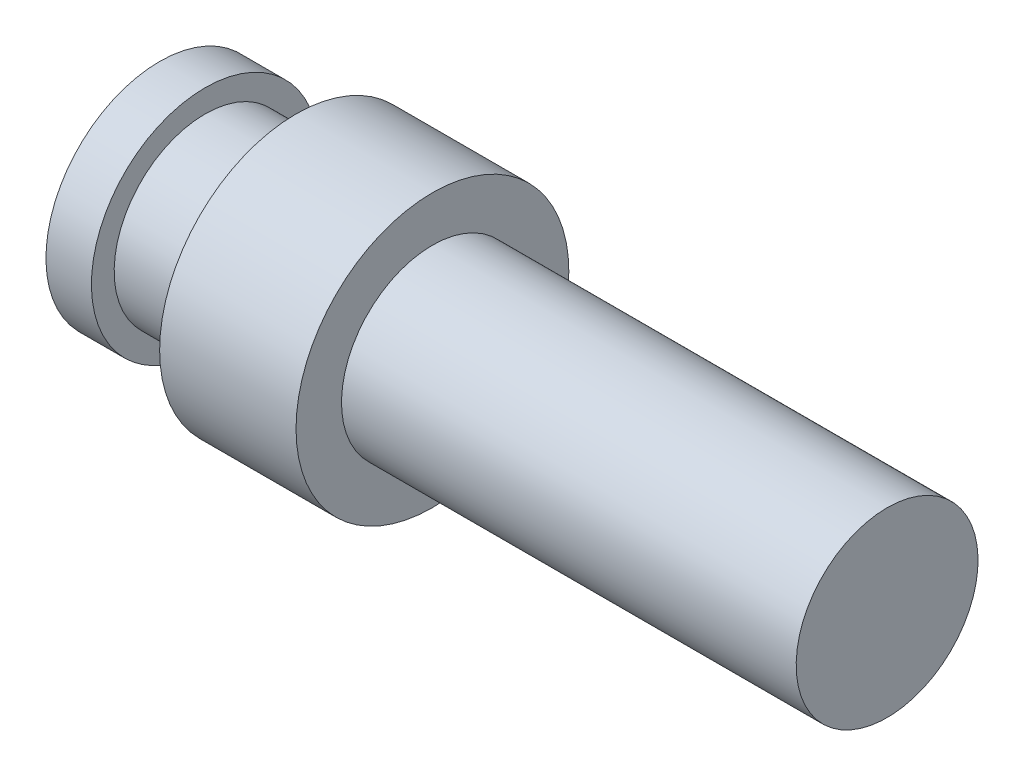
ISO-10303-21;
HEADER;
FILE_DESCRIPTION(('STEP AP214'),'2;1');
FILE_NAME('part.step','',(''),(''),'','','');
FILE_SCHEMA(('AUTOMOTIVE_DESIGN { 1 0 10303 214 1 1 1 1 }'));
ENDSEC;
DATA;
#1=APPLICATION_CONTEXT('core data for automotive mechanical design processes');
#2=APPLICATION_PROTOCOL_DEFINITION('international standard','automotive_design',2000,#1);
#3=PRODUCT_CONTEXT('',#1,'mechanical');
#4=PRODUCT('Part','Part','',(#3));
#5=PRODUCT_RELATED_PRODUCT_CATEGORY('part','',(#4));
#6=PRODUCT_DEFINITION_FORMATION('','',#4);
#7=PRODUCT_DEFINITION_CONTEXT('part definition',#1,'design');
#8=PRODUCT_DEFINITION('design','',#6,#7);
#9=PRODUCT_DEFINITION_SHAPE('','',#8);
#10=(LENGTH_UNIT() NAMED_UNIT(*) SI_UNIT(.MILLI.,.METRE.));
#11=(NAMED_UNIT(*) PLANE_ANGLE_UNIT() SI_UNIT($,.RADIAN.));
#12=(NAMED_UNIT(*) SI_UNIT($,.STERADIAN.) SOLID_ANGLE_UNIT());
#13=UNCERTAINTY_MEASURE_WITH_UNIT(LENGTH_MEASURE(1.E-05),#10,'distance_accuracy_value','');
#14=(GEOMETRIC_REPRESENTATION_CONTEXT(3) GLOBAL_UNCERTAINTY_ASSIGNED_CONTEXT((#13)) GLOBAL_UNIT_ASSIGNED_CONTEXT((#10,
#11,#12)) REPRESENTATION_CONTEXT('',''));
#15=CARTESIAN_POINT('',(0.,0.,0.));
#16=DIRECTION('',(0.,0.,1.));
#17=DIRECTION('',(1.,0.,0.));
#18=AXIS2_PLACEMENT_3D('',#15,#16,#17);
#19=CARTESIAN_POINT('',(0.,0.,0.));
#20=DIRECTION('',(-1.,0.,0.));
#21=DIRECTION('',(0.,-1.,0.));
#22=AXIS2_PLACEMENT_3D('',#19,#20,#21);
#23=PLANE('',#22);
#24=CARTESIAN_POINT('',(0.,0.,0.));
#25=DIRECTION('',(1.,0.,0.));
#26=DIRECTION('',(0.,1.,0.));
#27=AXIS2_PLACEMENT_3D('',#24,#25,#26);
#28=CIRCLE('',#27,2.5);
#29=CARTESIAN_POINT('',(0.,2.5,0.));
#30=VERTEX_POINT('',#29);
#31=EDGE_CURVE('E10',#30,#30,#28,.T.);
#32=ORIENTED_EDGE('',*,*,#31,.F.);
#33=EDGE_LOOP('',(#32));
#34=FACE_BOUND('',#33,.T.);
#35=ADVANCED_FACE('F36',(#34),#23,.T.);
#36=CARTESIAN_POINT('',(16.,0.,0.));
#37=DIRECTION('',(1.,0.,0.));
#38=DIRECTION('',(0.,1.,0.));
#39=AXIS2_PLACEMENT_3D('',#36,#37,#38);
#40=CYLINDRICAL_SURFACE('',#39,2.5);
#41=ORIENTED_EDGE('',*,*,#31,.T.);
#42=EDGE_LOOP('',(#41));
#43=FACE_BOUND('',#42,.T.);
#44=CARTESIAN_POINT('',(1.,0.,0.));
#45=DIRECTION('',(1.,0.,0.));
#46=DIRECTION('',(0.,1.,0.));
#47=AXIS2_PLACEMENT_3D('',#44,#45,#46);
#48=CIRCLE('',#47,2.5);
#49=CARTESIAN_POINT('',(1.,2.5,0.));
#50=VERTEX_POINT('',#49);
#51=EDGE_CURVE('E42',#50,#50,#48,.T.);
#52=ORIENTED_EDGE('',*,*,#51,.F.);
#53=EDGE_LOOP('',(#52));
#54=FACE_BOUND('',#53,.T.);
#55=ADVANCED_FACE('F84',(#43,#54),#40,.T.);
#56=CARTESIAN_POINT('',(1.,2.5,0.));
#57=DIRECTION('',(1.,0.,0.));
#58=DIRECTION('',(0.,1.,0.));
#59=AXIS2_PLACEMENT_3D('',#56,#57,#58);
#60=PLANE('',#59);
#61=ORIENTED_EDGE('',*,*,#51,.T.);
#62=EDGE_LOOP('',(#61));
#63=FACE_BOUND('',#62,.T.);
#64=CARTESIAN_POINT('',(1.,0.,0.));
#65=DIRECTION('',(1.,0.,0.));
#66=DIRECTION('',(0.,1.,0.));
#67=AXIS2_PLACEMENT_3D('',#64,#65,#66);
#68=CIRCLE('',#67,2.);
#69=CARTESIAN_POINT('',(1.,2.,0.));
#70=VERTEX_POINT('',#69);
#71=EDGE_CURVE('E46',#70,#70,#68,.T.);
#72=ORIENTED_EDGE('',*,*,#71,.F.);
#73=EDGE_LOOP('',(#72));
#74=FACE_BOUND('',#73,.T.);
#75=ADVANCED_FACE('F88',(#63,#74),#60,.T.);
#76=CARTESIAN_POINT('',(16.,0.,0.));
#77=DIRECTION('',(1.,0.,0.));
#78=DIRECTION('',(0.,1.,0.));
#79=AXIS2_PLACEMENT_3D('',#76,#77,#78);
#80=CYLINDRICAL_SURFACE('',#79,2.);
#81=ORIENTED_EDGE('',*,*,#71,.T.);
#82=EDGE_LOOP('',(#81));
#83=FACE_BOUND('',#82,.T.);
#84=CARTESIAN_POINT('',(3.,0.,0.));
#85=DIRECTION('',(1.,0.,0.));
#86=DIRECTION('',(0.,1.,0.));
#87=AXIS2_PLACEMENT_3D('',#84,#85,#86);
#88=CIRCLE('',#87,2.);
#89=CARTESIAN_POINT('',(3.,2.,0.));
#90=VERTEX_POINT('',#89);
#91=EDGE_CURVE('E50',#90,#90,#88,.T.);
#92=ORIENTED_EDGE('',*,*,#91,.F.);
#93=EDGE_LOOP('',(#92));
#94=FACE_BOUND('',#93,.T.);
#95=ADVANCED_FACE('F92',(#83,#94),#80,.T.);
#96=CARTESIAN_POINT('',(3.,2.,0.));
#97=DIRECTION('',(-1.,0.,0.));
#98=DIRECTION('',(0.,-1.,0.));
#99=AXIS2_PLACEMENT_3D('',#96,#97,#98);
#100=PLANE('',#99);
#101=ORIENTED_EDGE('',*,*,#91,.T.);
#102=EDGE_LOOP('',(#101));
#103=FACE_BOUND('',#102,.T.);
#104=CARTESIAN_POINT('',(3.,0.,0.));
#105=DIRECTION('',(1.,0.,0.));
#106=DIRECTION('',(0.,1.,0.));
#107=AXIS2_PLACEMENT_3D('',#104,#105,#106);
#108=CIRCLE('',#107,3.);
#109=CARTESIAN_POINT('',(3.,3.,0.));
#110=VERTEX_POINT('',#109);
#111=EDGE_CURVE('E55',#110,#110,#108,.T.);
#112=ORIENTED_EDGE('',*,*,#111,.F.);
#113=EDGE_LOOP('',(#112));
#114=FACE_BOUND('',#113,.T.);
#115=ADVANCED_FACE('F98',(#103,#114),#100,.T.);
#116=CARTESIAN_POINT('',(16.,0.,0.));
#117=DIRECTION('',(1.,0.,0.));
#118=DIRECTION('',(0.,1.,0.));
#119=AXIS2_PLACEMENT_3D('',#116,#117,#118);
#120=CYLINDRICAL_SURFACE('',#119,3.);
#121=ORIENTED_EDGE('',*,*,#111,.T.);
#122=EDGE_LOOP('',(#121));
#123=FACE_BOUND('',#122,.T.);
#124=CARTESIAN_POINT('',(6.,0.,0.));
#125=DIRECTION('',(1.,0.,0.));
#126=DIRECTION('',(0.,1.,0.));
#127=AXIS2_PLACEMENT_3D('',#124,#125,#126);
#128=CIRCLE('',#127,3.);
#129=CARTESIAN_POINT('',(6.,3.,0.));
#130=VERTEX_POINT('',#129);
#131=EDGE_CURVE('E58',#130,#130,#128,.T.);
#132=ORIENTED_EDGE('',*,*,#131,.F.);
#133=EDGE_LOOP('',(#132));
#134=FACE_BOUND('',#133,.T.);
#135=ADVANCED_FACE('F80',(#123,#134),#120,.T.);
#136=CARTESIAN_POINT('',(6.,3.,0.));
#137=DIRECTION('',(1.,0.,0.));
#138=DIRECTION('',(0.,1.,0.));
#139=AXIS2_PLACEMENT_3D('',#136,#137,#138);
#140=PLANE('',#139);
#141=ORIENTED_EDGE('',*,*,#131,.T.);
#142=EDGE_LOOP('',(#141));
#143=FACE_BOUND('',#142,.T.);
#144=CARTESIAN_POINT('',(6.,0.,0.));
#145=DIRECTION('',(1.,0.,0.));
#146=DIRECTION('',(0.,1.,0.));
#147=AXIS2_PLACEMENT_3D('',#144,#145,#146);
#148=CIRCLE('',#147,2.);
#149=CARTESIAN_POINT('',(6.,2.,0.));
#150=VERTEX_POINT('',#149);
#151=EDGE_CURVE('E61',#150,#150,#148,.T.);
#152=ORIENTED_EDGE('',*,*,#151,.F.);
#153=EDGE_LOOP('',(#152));
#154=FACE_BOUND('',#153,.T.);
#155=ADVANCED_FACE('F72',(#143,#154),#140,.T.);
#156=CARTESIAN_POINT('',(16.,0.,0.));
#157=DIRECTION('',(1.,0.,0.));
#158=DIRECTION('',(0.,1.,0.));
#159=AXIS2_PLACEMENT_3D('',#156,#157,#158);
#160=CYLINDRICAL_SURFACE('',#159,2.);
#161=ORIENTED_EDGE('',*,*,#151,.T.);
#162=EDGE_LOOP('',(#161));
#163=FACE_BOUND('',#162,.T.);
#164=CARTESIAN_POINT('',(16.,0.,0.));
#165=DIRECTION('',(1.,0.,0.));
#166=DIRECTION('',(0.,1.,0.));
#167=AXIS2_PLACEMENT_3D('',#164,#165,#166);
#168=CIRCLE('',#167,2.);
#169=CARTESIAN_POINT('',(16.,2.,0.));
#170=VERTEX_POINT('',#169);
#171=EDGE_CURVE('E64',#170,#170,#168,.T.);
#172=ORIENTED_EDGE('',*,*,#171,.F.);
#173=EDGE_LOOP('',(#172));
#174=FACE_BOUND('',#173,.T.);
#175=ADVANCED_FACE('F70',(#163,#174),#160,.T.);
#176=CARTESIAN_POINT('',(16.,2.,0.));
#177=DIRECTION('',(1.,0.,0.));
#178=DIRECTION('',(0.,1.,0.));
#179=AXIS2_PLACEMENT_3D('',#176,#177,#178);
#180=PLANE('',#179);
#181=ORIENTED_EDGE('',*,*,#171,.T.);
#182=EDGE_LOOP('',(#181));
#183=FACE_BOUND('',#182,.T.);
#184=ADVANCED_FACE('F68',(#183),#180,.T.);
#185=CLOSED_SHELL('',(#35,#55,#75,#95,#115,#135,#155,#175,#184));
#186=MANIFOLD_SOLID_BREP('B2',#185);
#187=ADVANCED_BREP_SHAPE_REPRESENTATION('',(#18,#186),#14);
#188=SHAPE_DEFINITION_REPRESENTATION(#9,#187);
ENDSEC;
END-ISO-10303-21;
